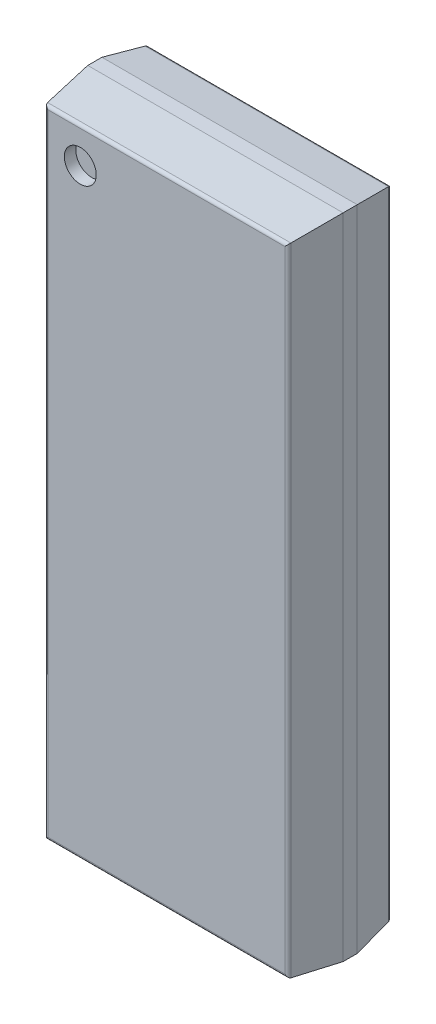
ISO-10303-21;
HEADER;
FILE_DESCRIPTION(('STEP AP214'),'2;1');
FILE_NAME('part.step','',(''),(''),'','','');
FILE_SCHEMA(('AUTOMOTIVE_DESIGN { 1 0 10303 214 1 1 1 1 }'));
ENDSEC;
DATA;
#1=APPLICATION_CONTEXT('core data for automotive mechanical design processes');
#2=APPLICATION_PROTOCOL_DEFINITION('international standard','automotive_design',2000,#1);
#3=PRODUCT_CONTEXT('',#1,'mechanical');
#4=PRODUCT('Part','Part','',(#3));
#5=PRODUCT_RELATED_PRODUCT_CATEGORY('part','',(#4));
#6=PRODUCT_DEFINITION_FORMATION('','',#4);
#7=PRODUCT_DEFINITION_CONTEXT('part definition',#1,'design');
#8=PRODUCT_DEFINITION('design','',#6,#7);
#9=PRODUCT_DEFINITION_SHAPE('','',#8);
#10=(LENGTH_UNIT() NAMED_UNIT(*) SI_UNIT(.MILLI.,.METRE.));
#11=(NAMED_UNIT(*) PLANE_ANGLE_UNIT() SI_UNIT($,.RADIAN.));
#12=(NAMED_UNIT(*) SI_UNIT($,.STERADIAN.) SOLID_ANGLE_UNIT());
#13=UNCERTAINTY_MEASURE_WITH_UNIT(LENGTH_MEASURE(1.E-05),#10,'distance_accuracy_value','');
#14=(GEOMETRIC_REPRESENTATION_CONTEXT(3) GLOBAL_UNCERTAINTY_ASSIGNED_CONTEXT((#13)) GLOBAL_UNIT_ASSIGNED_CONTEXT((#10,
#11,#12)) REPRESENTATION_CONTEXT('',''));
#15=CARTESIAN_POINT('',(0.,0.,0.));
#16=DIRECTION('',(0.,0.,1.));
#17=DIRECTION('',(1.,0.,0.));
#18=AXIS2_PLACEMENT_3D('',#15,#16,#17);
#19=CARTESIAN_POINT('',(-1.31465,4.31615,1.5777));
#20=DIRECTION('',(0.,0.,1.));
#21=DIRECTION('',(1.,0.,0.));
#22=AXIS2_PLACEMENT_3D('',#19,#20,#21);
#23=PLANE('',#22);
#24=CARTESIAN_POINT('',(-1.31465,4.31615,1.5777));
#25=DIRECTION('',(0.,0.,1.));
#26=DIRECTION('',(1.,0.,0.));
#27=AXIS2_PLACEMENT_3D('',#24,#25,#26);
#28=CIRCLE('',#27,0.2436875);
#29=CARTESIAN_POINT('',(-1.0709625,4.31615,1.5777));
#30=VERTEX_POINT('',#29);
#31=EDGE_CURVE('E11',#30,#30,#28,.T.);
#32=ORIENTED_EDGE('',*,*,#31,.T.);
#33=EDGE_LOOP('',(#32));
#34=FACE_BOUND('',#33,.T.);
#35=ADVANCED_FACE('F17',(#34),#23,.T.);
#36=CARTESIAN_POINT('',(-1.31465,4.31615,1.5777));
#37=DIRECTION('',(0.,0.,1.));
#38=DIRECTION('',(1.,0.,0.));
#39=AXIS2_PLACEMENT_3D('',#36,#37,#38);
#40=CYLINDRICAL_SURFACE('',#39,0.2436875);
#41=DIRECTION('',(0.,0.,1.));
#42=VECTOR('',#41,1.);
#43=CARTESIAN_POINT('',(-1.0709625,4.31615,1.5777));
#44=LINE('',#43,#42);
#45=CARTESIAN_POINT('',(-1.0709625,4.31615,1.753));
#46=VERTEX_POINT('',#45);
#47=EDGE_CURVE('E25',#30,#46,#44,.T.);
#48=ORIENTED_EDGE('',*,*,#47,.T.);
#49=CARTESIAN_POINT('',(-1.31465,4.31615,1.753));
#50=DIRECTION('',(0.,0.,1.));
#51=DIRECTION('',(1.,0.,0.));
#52=AXIS2_PLACEMENT_3D('',#49,#50,#51);
#53=CIRCLE('',#52,0.2436875);
#54=EDGE_CURVE('E327',#46,#46,#53,.T.);
#55=ORIENTED_EDGE('',*,*,#54,.T.);
#56=ORIENTED_EDGE('',*,*,#47,.F.);
#57=ORIENTED_EDGE('',*,*,#31,.F.);
#58=EDGE_LOOP('',(#48,#55,#56,#57));
#59=FACE_BOUND('',#58,.T.);
#60=ADVANCED_FACE('F527',(#59),#40,.F.);
#61=CARTESIAN_POINT('',(1.808111155281,-4.853525,1.703));
#62=DIRECTION('',(0.,1.,0.));
#63=DIRECTION('',(0.,0.,1.));
#64=AXIS2_PLACEMENT_3D('',#61,#62,#63);
#65=CYLINDRICAL_SURFACE('',#64,0.05);
#66=CARTESIAN_POINT('',(1.808111155281,-4.809611155281,1.703));
#67=DIRECTION('',(-0.707106781186548,-0.707106781186548,0.));
#68=DIRECTION('',(0.707106781186548,-0.707106781186548,0.));
#69=AXIS2_PLACEMENT_3D('',#66,#67,#68);
#70=ELLIPSE('',#69,0.07071067811865,0.05);
#71=CARTESIAN_POINT('',(1.857692933456,-4.859192933456,1.709453469848));
#72=VERTEX_POINT('',#71);
#73=CARTESIAN_POINT('',(1.808111155281,-4.809611155281,1.753));
#74=VERTEX_POINT('',#73);
#75=EDGE_CURVE('E317',#72,#74,#70,.T.);
#76=ORIENTED_EDGE('',*,*,#75,.F.);
#77=DIRECTION('',(0.,1.,0.));
#78=VECTOR('',#77,1.);
#79=CARTESIAN_POINT('',(1.857692933456,-4.853525,1.709453469848));
#80=LINE('',#79,#78);
#81=CARTESIAN_POINT('',(1.857692933456,4.859192933456,1.709453469848));
#82=VERTEX_POINT('',#81);
#83=EDGE_CURVE('E313',#72,#82,#80,.T.);
#84=ORIENTED_EDGE('',*,*,#83,.T.);
#85=CARTESIAN_POINT('',(1.808111155281,4.809611155281,1.703));
#86=DIRECTION('',(-0.707106781186548,0.707106781186548,0.));
#87=DIRECTION('',(0.707106781186548,0.707106781186548,0.));
#88=AXIS2_PLACEMENT_3D('',#85,#86,#87);
#89=ELLIPSE('',#88,0.07071067811865,0.05);
#90=CARTESIAN_POINT('',(1.808111155281,4.809611155281,1.753));
#91=VERTEX_POINT('',#90);
#92=EDGE_CURVE('E330',#91,#82,#89,.T.);
#93=ORIENTED_EDGE('',*,*,#92,.F.);
#94=DIRECTION('',(0.,1.,0.));
#95=VECTOR('',#94,1.);
#96=CARTESIAN_POINT('',(1.808111155281,-4.853525,1.753));
#97=LINE('',#96,#95);
#98=EDGE_CURVE('E222',#74,#91,#97,.T.);
#99=ORIENTED_EDGE('',*,*,#98,.F.);
#100=EDGE_LOOP('',(#76,#84,#93,#99));
#101=FACE_BOUND('',#100,.T.);
#102=ADVANCED_FACE('F531',(#101),#65,.T.);
#103=CARTESIAN_POINT('',(-1.852025,4.809611155281,1.703));
#104=DIRECTION('',(1.,0.,0.));
#105=DIRECTION('',(0.,0.,1.));
#106=AXIS2_PLACEMENT_3D('',#103,#104,#105);
#107=CYLINDRICAL_SURFACE('',#106,0.05);
#108=DIRECTION('',(1.,0.,0.));
#109=VECTOR('',#108,1.);
#110=CARTESIAN_POINT('',(-1.852025,4.809611155281,1.753));
#111=LINE('',#110,#109);
#112=CARTESIAN_POINT('',(-1.808111155281,4.809611155281,1.753));
#113=VERTEX_POINT('',#112);
#114=EDGE_CURVE('E226',#113,#91,#111,.T.);
#115=ORIENTED_EDGE('',*,*,#114,.T.);
#116=ORIENTED_EDGE('',*,*,#92,.T.);
#117=DIRECTION('',(1.,0.,0.));
#118=VECTOR('',#117,1.);
#119=CARTESIAN_POINT('',(-1.852025,4.859192933456,1.709453469848));
#120=LINE('',#119,#118);
#121=CARTESIAN_POINT('',(-1.857692933456,4.859192933456,1.709453469848));
#122=VERTEX_POINT('',#121);
#123=EDGE_CURVE('E274',#122,#82,#120,.T.);
#124=ORIENTED_EDGE('',*,*,#123,.F.);
#125=CARTESIAN_POINT('',(-1.808111155281,4.809611155281,1.703));
#126=DIRECTION('',(0.707106781186548,0.707106781186548,0.));
#127=DIRECTION('',(-0.707106781186548,0.707106781186548,0.));
#128=AXIS2_PLACEMENT_3D('',#125,#126,#127);
#129=ELLIPSE('',#128,0.07071067811865,0.05);
#130=EDGE_CURVE('E270',#122,#113,#129,.T.);
#131=ORIENTED_EDGE('',*,*,#130,.T.);
#132=EDGE_LOOP('',(#115,#116,#124,#131));
#133=FACE_BOUND('',#132,.T.);
#134=ADVANCED_FACE('F535',(#133),#107,.T.);
#135=CARTESIAN_POINT('',(-1.9495,-4.951,1.753));
#136=DIRECTION('',(0.,0.,1.));
#137=DIRECTION('',(1.,0.,0.));
#138=AXIS2_PLACEMENT_3D('',#135,#136,#137);
#139=PLANE('',#138);
#140=ORIENTED_EDGE('',*,*,#54,.F.);
#141=EDGE_LOOP('',(#140));
#142=FACE_BOUND('',#141,.T.);
#143=DIRECTION('',(0.,1.,0.));
#144=VECTOR('',#143,1.);
#145=CARTESIAN_POINT('',(-1.808111155281,-4.853525,1.753));
#146=LINE('',#145,#144);
#147=CARTESIAN_POINT('',(-1.808111155281,-4.809611155281,1.753));
#148=VERTEX_POINT('',#147);
#149=EDGE_CURVE('E275',#148,#113,#146,.T.);
#150=ORIENTED_EDGE('',*,*,#149,.F.);
#151=DIRECTION('',(1.,0.,0.));
#152=VECTOR('',#151,1.);
#153=CARTESIAN_POINT('',(-1.852025,-4.809611155281,1.753));
#154=LINE('',#153,#152);
#155=EDGE_CURVE('E227',#148,#74,#154,.T.);
#156=ORIENTED_EDGE('',*,*,#155,.T.);
#157=ORIENTED_EDGE('',*,*,#98,.T.);
#158=ORIENTED_EDGE('',*,*,#114,.F.);
#159=EDGE_LOOP('',(#150,#156,#157,#158));
#160=FACE_BOUND('',#159,.T.);
#161=ADVANCED_FACE('F541',(#142,#160),#139,.T.);
#162=CARTESIAN_POINT('',(-1.852025,-4.809611155281,1.703));
#163=DIRECTION('',(1.,0.,0.));
#164=DIRECTION('',(0.,-0.991635563486124,0.129069396952016));
#165=AXIS2_PLACEMENT_3D('',#162,#163,#164);
#166=CYLINDRICAL_SURFACE('',#165,0.05);
#167=DIRECTION('',(1.,0.,0.));
#168=VECTOR('',#167,1.);
#169=CARTESIAN_POINT('',(-1.852025,-4.859192933456,1.709453469848));
#170=LINE('',#169,#168);
#171=CARTESIAN_POINT('',(-1.857692933456,-4.859192933456,1.709453469848));
#172=VERTEX_POINT('',#171);
#173=EDGE_CURVE('E295',#172,#72,#170,.T.);
#174=ORIENTED_EDGE('',*,*,#173,.T.);
#175=ORIENTED_EDGE('',*,*,#75,.T.);
#176=ORIENTED_EDGE('',*,*,#155,.F.);
#177=CARTESIAN_POINT('',(-1.808111155281,-4.809611155281,1.703));
#178=DIRECTION('',(-0.707106781186548,0.707106781186548,0.));
#179=DIRECTION('',(0.707106781186548,0.707106781186548,0.));
#180=AXIS2_PLACEMENT_3D('',#177,#178,#179);
#181=ELLIPSE('',#180,0.07071067811865,0.05);
#182=EDGE_CURVE('E299',#172,#148,#181,.T.);
#183=ORIENTED_EDGE('',*,*,#182,.F.);
#184=EDGE_LOOP('',(#174,#175,#176,#183));
#185=FACE_BOUND('',#184,.T.);
#186=ADVANCED_FACE('F543',(#185),#166,.T.);
#187=CARTESIAN_POINT('',(1.9007625,-4.951,1.378551529514));
#188=DIRECTION('',(0.991635563486124,0.,0.129069396952016));
#189=DIRECTION('',(0.,-1.,0.));
#190=AXIS2_PLACEMENT_3D('',#187,#188,#189);
#191=PLANE('',#190);
#192=DIRECTION('',(-0.128007567691047,0.128007567691047,0.98347756722136));
#193=VECTOR('',#192,1.);
#194=CARTESIAN_POINT('',(1.869616724689,-4.871116724689,1.61784340799));
#195=LINE('',#194,#193);
#196=CARTESIAN_POINT('',(1.9495,-4.951,1.004103059027));
#197=VERTEX_POINT('',#196);
#198=EDGE_CURVE('E291',#197,#72,#195,.T.);
#199=ORIENTED_EDGE('',*,*,#198,.F.);
#200=DIRECTION('',(0.,1.,0.));
#201=VECTOR('',#200,1.);
#202=CARTESIAN_POINT('',(1.9495,-4.951,1.004103059027));
#203=LINE('',#202,#201);
#204=CARTESIAN_POINT('',(1.9495,4.951,1.004103059027));
#205=VERTEX_POINT('',#204);
#206=EDGE_CURVE('E287',#197,#205,#203,.T.);
#207=ORIENTED_EDGE('',*,*,#206,.T.);
#208=DIRECTION('',(-0.128007567691047,-0.128007567691047,0.98347756722136));
#209=VECTOR('',#208,1.);
#210=CARTESIAN_POINT('',(1.788489948691,4.789989948691,2.241137528291));
#211=LINE('',#210,#209);
#212=EDGE_CURVE('E309',#205,#82,#211,.T.);
#213=ORIENTED_EDGE('',*,*,#212,.T.);
#214=ORIENTED_EDGE('',*,*,#83,.F.);
#215=EDGE_LOOP('',(#199,#207,#213,#214));
#216=FACE_BOUND('',#215,.T.);
#217=ADVANCED_FACE('F548',(#216),#191,.T.);
#218=CARTESIAN_POINT('',(-1.9495,4.9022625,1.378551529514));
#219=DIRECTION('',(0.,0.991635563486124,0.129069396952016));
#220=DIRECTION('',(1.,0.,0.));
#221=AXIS2_PLACEMENT_3D('',#218,#219,#220);
#222=PLANE('',#221);
#223=ORIENTED_EDGE('',*,*,#123,.T.);
#224=ORIENTED_EDGE('',*,*,#212,.F.);
#225=DIRECTION('',(1.,0.,0.));
#226=VECTOR('',#225,1.);
#227=CARTESIAN_POINT('',(-1.9495,4.951,1.004103059027));
#228=LINE('',#227,#226);
#229=CARTESIAN_POINT('',(-1.9495,4.951,1.004103059027));
#230=VERTEX_POINT('',#229);
#231=EDGE_CURVE('E283',#230,#205,#228,.T.);
#232=ORIENTED_EDGE('',*,*,#231,.F.);
#233=DIRECTION('',(0.128007567691047,-0.128007567691047,0.98347756722136));
#234=VECTOR('',#233,1.);
#235=CARTESIAN_POINT('',(-1.820434333625,4.821934333625,1.995709960622));
#236=LINE('',#235,#234);
#237=EDGE_CURVE('E219',#230,#122,#236,.T.);
#238=ORIENTED_EDGE('',*,*,#237,.T.);
#239=EDGE_LOOP('',(#223,#224,#232,#238));
#240=FACE_BOUND('',#239,.T.);
#241=ADVANCED_FACE('F509',(#240),#222,.T.);
#242=CARTESIAN_POINT('',(-1.808111155281,-4.853525,1.703));
#243=DIRECTION('',(0.,1.,0.));
#244=DIRECTION('',(-0.991635563486124,0.,0.129069396952016));
#245=AXIS2_PLACEMENT_3D('',#242,#243,#244);
#246=CYLINDRICAL_SURFACE('',#245,0.05);
#247=ORIENTED_EDGE('',*,*,#182,.T.);
#248=ORIENTED_EDGE('',*,*,#149,.T.);
#249=ORIENTED_EDGE('',*,*,#130,.F.);
#250=DIRECTION('',(0.,1.,0.));
#251=VECTOR('',#250,1.);
#252=CARTESIAN_POINT('',(-1.857692933456,-4.853525,1.709453469848));
#253=LINE('',#252,#251);
#254=EDGE_CURVE('E216',#172,#122,#253,.T.);
#255=ORIENTED_EDGE('',*,*,#254,.F.);
#256=EDGE_LOOP('',(#247,#248,#249,#255));
#257=FACE_BOUND('',#256,.T.);
#258=ADVANCED_FACE('F505',(#257),#246,.T.);
#259=CARTESIAN_POINT('',(-1.9495,-4.9022625,1.378551529514));
#260=DIRECTION('',(0.,0.991635563486124,-0.129069396952016));
#261=DIRECTION('',(-1.,0.,0.));
#262=AXIS2_PLACEMENT_3D('',#259,#260,#261);
#263=PLANE('',#262);
#264=DIRECTION('',(0.128007567691047,0.128007567691047,0.98347756722136));
#265=VECTOR('',#264,1.);
#266=CARTESIAN_POINT('',(-1.901561109623,-4.903061109623,1.372415840322));
#267=LINE('',#266,#265);
#268=CARTESIAN_POINT('',(-1.9495,-4.951,1.004103059027));
#269=VERTEX_POINT('',#268);
#270=EDGE_CURVE('E241',#269,#172,#267,.T.);
#271=ORIENTED_EDGE('',*,*,#270,.F.);
#272=DIRECTION('',(1.,0.,0.));
#273=VECTOR('',#272,1.);
#274=CARTESIAN_POINT('',(-1.9495,-4.951,1.004103059027));
#275=LINE('',#274,#273);
#276=EDGE_CURVE('E148',#269,#197,#275,.T.);
#277=ORIENTED_EDGE('',*,*,#276,.T.);
#278=ORIENTED_EDGE('',*,*,#198,.T.);
#279=ORIENTED_EDGE('',*,*,#173,.F.);
#280=EDGE_LOOP('',(#271,#277,#278,#279));
#281=FACE_BOUND('',#280,.T.);
#282=ADVANCED_FACE('F497',(#281),#263,.F.);
#283=CARTESIAN_POINT('',(1.9495,-4.951,0.178));
#284=DIRECTION('',(1.,0.,0.));
#285=DIRECTION('',(0.,1.,0.));
#286=AXIS2_PLACEMENT_3D('',#283,#284,#285);
#287=PLANE('',#286);
#288=DIRECTION('',(0.,0.,1.));
#289=VECTOR('',#288,1.);
#290=CARTESIAN_POINT('',(1.9495,-4.951,0.178));
#291=LINE('',#290,#289);
#292=CARTESIAN_POINT('',(1.9495,-4.951,0.788103059027));
#293=VERTEX_POINT('',#292);
#294=EDGE_CURVE('E259',#293,#197,#291,.T.);
#295=ORIENTED_EDGE('',*,*,#294,.F.);
#296=DIRECTION('',(0.,1.,0.));
#297=VECTOR('',#296,1.);
#298=CARTESIAN_POINT('',(1.9495,-4.951,0.788103059027));
#299=LINE('',#298,#297);
#300=CARTESIAN_POINT('',(1.9495,4.951,0.788103059027));
#301=VERTEX_POINT('',#300);
#302=EDGE_CURVE('E247',#293,#301,#299,.T.);
#303=ORIENTED_EDGE('',*,*,#302,.T.);
#304=DIRECTION('',(0.,0.,1.));
#305=VECTOR('',#304,1.);
#306=CARTESIAN_POINT('',(1.9495,4.951,0.178));
#307=LINE('',#306,#305);
#308=EDGE_CURVE('E279',#301,#205,#307,.T.);
#309=ORIENTED_EDGE('',*,*,#308,.T.);
#310=ORIENTED_EDGE('',*,*,#206,.F.);
#311=EDGE_LOOP('',(#295,#303,#309,#310));
#312=FACE_BOUND('',#311,.T.);
#313=ADVANCED_FACE('F495',(#312),#287,.T.);
#314=CARTESIAN_POINT('',(1.809379279549,-4.853525,0.228));
#315=DIRECTION('',(0.,1.,0.));
#316=DIRECTION('',(0.,0.,-1.));
#317=AXIS2_PLACEMENT_3D('',#314,#315,#316);
#318=CYLINDRICAL_SURFACE('',#317,0.05);
#319=DIRECTION('',(0.,1.,0.));
#320=VECTOR('',#319,1.);
#321=CARTESIAN_POINT('',(1.809379279549,-4.853525,0.178));
#322=LINE('',#321,#320);
#323=CARTESIAN_POINT('',(1.809379279549,-4.810879279549,0.178));
#324=VERTEX_POINT('',#323);
#325=CARTESIAN_POINT('',(1.809379279549,4.810879279549,0.178));
#326=VERTEX_POINT('',#325);
#327=EDGE_CURVE('E246',#324,#326,#322,.T.);
#328=ORIENTED_EDGE('',*,*,#327,.T.);
#329=CARTESIAN_POINT('',(1.809379279549,4.810879279549,0.228));
#330=DIRECTION('',(0.707106781186548,-0.707106781186548,0.));
#331=DIRECTION('',(0.707106781186548,0.707106781186548,0.));
#332=AXIS2_PLACEMENT_3D('',#329,#330,#331);
#333=ELLIPSE('',#332,0.07071067811865,0.05);
#334=CARTESIAN_POINT('',(1.858753096203,4.860253096203,0.220111639653));
#335=VERTEX_POINT('',#334);
#336=EDGE_CURVE('E220',#326,#335,#333,.T.);
#337=ORIENTED_EDGE('',*,*,#336,.T.);
#338=DIRECTION('',(0.,1.,0.));
#339=VECTOR('',#338,1.);
#340=CARTESIAN_POINT('',(1.858753096203,-4.853525,0.220111639653));
#341=LINE('',#340,#339);
#342=CARTESIAN_POINT('',(1.858753096203,-4.860253096203,0.220111639653));
#343=VERTEX_POINT('',#342);
#344=EDGE_CURVE('E253',#343,#335,#341,.T.);
#345=ORIENTED_EDGE('',*,*,#344,.F.);
#346=CARTESIAN_POINT('',(1.809379279549,-4.810879279549,0.228));
#347=DIRECTION('',(0.707106781186548,0.707106781186548,0.));
#348=DIRECTION('',(0.707106781186548,-0.707106781186548,0.));
#349=AXIS2_PLACEMENT_3D('',#346,#347,#348);
#350=ELLIPSE('',#349,0.07071067811865,0.05);
#351=EDGE_CURVE('E207',#343,#324,#350,.T.);
#352=ORIENTED_EDGE('',*,*,#351,.T.);
#353=EDGE_LOOP('',(#328,#337,#345,#352));
#354=FACE_BOUND('',#353,.T.);
#355=ADVANCED_FACE('F488',(#354),#318,.T.);
#356=CARTESIAN_POINT('',(-1.9495,4.951,0.178));
#357=DIRECTION('',(0.,1.,0.));
#358=DIRECTION('',(1.,0.,0.));
#359=AXIS2_PLACEMENT_3D('',#356,#357,#358);
#360=PLANE('',#359);
#361=ORIENTED_EDGE('',*,*,#308,.F.);
#362=DIRECTION('',(1.,0.,0.));
#363=VECTOR('',#362,1.);
#364=CARTESIAN_POINT('',(-1.9495,4.951,0.788103059027));
#365=LINE('',#364,#363);
#366=CARTESIAN_POINT('',(-1.9495,4.951,0.788103059027));
#367=VERTEX_POINT('',#366);
#368=EDGE_CURVE('E154',#367,#301,#365,.T.);
#369=ORIENTED_EDGE('',*,*,#368,.F.);
#370=DIRECTION('',(0.,0.,1.));
#371=VECTOR('',#370,1.);
#372=CARTESIAN_POINT('',(-1.9495,4.951,0.178));
#373=LINE('',#372,#371);
#374=EDGE_CURVE('E155',#367,#230,#373,.T.);
#375=ORIENTED_EDGE('',*,*,#374,.T.);
#376=ORIENTED_EDGE('',*,*,#231,.T.);
#377=EDGE_LOOP('',(#361,#369,#375,#376));
#378=FACE_BOUND('',#377,.T.);
#379=ADVANCED_FACE('F511',(#378),#360,.T.);
#380=CARTESIAN_POINT('',(-1.9007625,-4.951,1.378551529514));
#381=DIRECTION('',(0.991635563486124,0.,-0.129069396952016));
#382=DIRECTION('',(0.,-1.,0.));
#383=AXIS2_PLACEMENT_3D('',#380,#381,#382);
#384=PLANE('',#383);
#385=ORIENTED_EDGE('',*,*,#254,.T.);
#386=ORIENTED_EDGE('',*,*,#237,.F.);
#387=DIRECTION('',(0.,1.,0.));
#388=VECTOR('',#387,1.);
#389=CARTESIAN_POINT('',(-1.9495,-4.951,1.004103059027));
#390=LINE('',#389,#388);
#391=EDGE_CURVE('E196',#269,#230,#390,.T.);
#392=ORIENTED_EDGE('',*,*,#391,.F.);
#393=ORIENTED_EDGE('',*,*,#270,.T.);
#394=EDGE_LOOP('',(#385,#386,#392,#393));
#395=FACE_BOUND('',#394,.T.);
#396=ADVANCED_FACE('F501',(#395),#384,.F.);
#397=CARTESIAN_POINT('',(-1.852025,4.810879279549,0.228));
#398=DIRECTION('',(1.,0.,0.));
#399=DIRECTION('',(0.,0.,-1.));
#400=AXIS2_PLACEMENT_3D('',#397,#398,#399);
#401=CYLINDRICAL_SURFACE('',#400,0.05);
#402=CARTESIAN_POINT('',(-1.809379279549,4.810879279549,0.228));
#403=DIRECTION('',(-0.707106781186548,-0.707106781186548,0.));
#404=DIRECTION('',(-0.707106781186548,0.707106781186548,0.));
#405=AXIS2_PLACEMENT_3D('',#402,#403,#404);
#406=ELLIPSE('',#405,0.07071067811865,0.05);
#407=CARTESIAN_POINT('',(-1.858753096203,4.860253096203,0.220111639653));
#408=VERTEX_POINT('',#407);
#409=CARTESIAN_POINT('',(-1.809379279549,4.810879279549,0.178));
#410=VERTEX_POINT('',#409);
#411=EDGE_CURVE('E166',#408,#410,#406,.T.);
#412=ORIENTED_EDGE('',*,*,#411,.F.);
#413=DIRECTION('',(1.,0.,0.));
#414=VECTOR('',#413,1.);
#415=CARTESIAN_POINT('',(-1.852025,4.860253096203,0.220111639653));
#416=LINE('',#415,#414);
#417=EDGE_CURVE('E231',#408,#335,#416,.T.);
#418=ORIENTED_EDGE('',*,*,#417,.T.);
#419=ORIENTED_EDGE('',*,*,#336,.F.);
#420=DIRECTION('',(1.,0.,0.));
#421=VECTOR('',#420,1.);
#422=CARTESIAN_POINT('',(-1.852025,4.810879279549,0.178));
#423=LINE('',#422,#421);
#424=EDGE_CURVE('E242',#410,#326,#423,.T.);
#425=ORIENTED_EDGE('',*,*,#424,.F.);
#426=EDGE_LOOP('',(#412,#418,#419,#425));
#427=FACE_BOUND('',#426,.T.);
#428=ADVANCED_FACE('F515',(#427),#401,.T.);
#429=CARTESIAN_POINT('',(-1.9495,-4.951,0.178));
#430=DIRECTION('',(0.,0.,1.));
#431=DIRECTION('',(1.,0.,0.));
#432=AXIS2_PLACEMENT_3D('',#429,#430,#431);
#433=PLANE('',#432);
#434=ORIENTED_EDGE('',*,*,#424,.T.);
#435=ORIENTED_EDGE('',*,*,#327,.F.);
#436=DIRECTION('',(1.,0.,0.));
#437=VECTOR('',#436,1.);
#438=CARTESIAN_POINT('',(-1.852025,-4.810879279549,0.178));
#439=LINE('',#438,#437);
#440=CARTESIAN_POINT('',(-1.809379279549,-4.810879279549,0.178));
#441=VERTEX_POINT('',#440);
#442=EDGE_CURVE('E211',#441,#324,#439,.T.);
#443=ORIENTED_EDGE('',*,*,#442,.F.);
#444=DIRECTION('',(0.,1.,0.));
#445=VECTOR('',#444,1.);
#446=CARTESIAN_POINT('',(-1.809379279549,-4.853525,0.178));
#447=LINE('',#446,#445);
#448=EDGE_CURVE('E200',#441,#410,#447,.T.);
#449=ORIENTED_EDGE('',*,*,#448,.T.);
#450=EDGE_LOOP('',(#434,#435,#443,#449));
#451=FACE_BOUND('',#450,.T.);
#452=ADVANCED_FACE('F486',(#451),#433,.F.);
#453=CARTESIAN_POINT('',(1.9007625,-4.951,0.483051529514));
#454=DIRECTION('',(-0.987476333090755,0.,0.157767206939961));
#455=DIRECTION('',(0.,1.,0.));
#456=AXIS2_PLACEMENT_3D('',#453,#454,#455);
#457=PLANE('',#456);
#458=ORIENTED_EDGE('',*,*,#344,.T.);
#459=DIRECTION('',(-0.155839664655945,-0.155839664655945,-0.975411706839653));
#460=VECTOR('',#459,1.);
#461=CARTESIAN_POINT('',(1.734360588525,4.735860588525,-0.558470042364));
#462=LINE('',#461,#460);
#463=EDGE_CURVE('E194',#301,#335,#462,.T.);
#464=ORIENTED_EDGE('',*,*,#463,.F.);
#465=ORIENTED_EDGE('',*,*,#302,.F.);
#466=DIRECTION('',(-0.155839664655945,0.155839664655945,-0.975411706839653));
#467=VECTOR('',#466,1.);
#468=CARTESIAN_POINT('',(1.854600579872,-4.856100579872,0.19412074028));
#469=LINE('',#468,#467);
#470=EDGE_CURVE('E164',#293,#343,#469,.T.);
#471=ORIENTED_EDGE('',*,*,#470,.T.);
#472=EDGE_LOOP('',(#458,#464,#465,#471));
#473=FACE_BOUND('',#472,.T.);
#474=ADVANCED_FACE('F490',(#473),#457,.F.);
#475=CARTESIAN_POINT('',(-1.9495,-4.951,0.178));
#476=DIRECTION('',(0.,1.,0.));
#477=DIRECTION('',(1.,0.,0.));
#478=AXIS2_PLACEMENT_3D('',#475,#476,#477);
#479=PLANE('',#478);
#480=ORIENTED_EDGE('',*,*,#276,.F.);
#481=DIRECTION('',(0.,0.,1.));
#482=VECTOR('',#481,1.);
#483=CARTESIAN_POINT('',(-1.9495,-4.951,0.178));
#484=LINE('',#483,#482);
#485=CARTESIAN_POINT('',(-1.9495,-4.951,0.788103059027));
#486=VERTEX_POINT('',#485);
#487=EDGE_CURVE('E141',#486,#269,#484,.T.);
#488=ORIENTED_EDGE('',*,*,#487,.F.);
#489=DIRECTION('',(1.,0.,0.));
#490=VECTOR('',#489,1.);
#491=CARTESIAN_POINT('',(-1.9495,-4.951,0.788103059027));
#492=LINE('',#491,#490);
#493=EDGE_CURVE('E145',#486,#293,#492,.T.);
#494=ORIENTED_EDGE('',*,*,#493,.T.);
#495=ORIENTED_EDGE('',*,*,#294,.T.);
#496=EDGE_LOOP('',(#480,#488,#494,#495));
#497=FACE_BOUND('',#496,.T.);
#498=ADVANCED_FACE('F143',(#497),#479,.F.);
#499=CARTESIAN_POINT('',(-1.852025,-4.810879279549,0.228));
#500=DIRECTION('',(1.,0.,0.));
#501=DIRECTION('',(0.,-0.987476333090755,-0.157767206939961));
#502=AXIS2_PLACEMENT_3D('',#499,#500,#501);
#503=CYLINDRICAL_SURFACE('',#502,0.05);
#504=CARTESIAN_POINT('',(-1.809379279549,-4.810879279549,0.228));
#505=DIRECTION('',(0.707106781186548,-0.707106781186548,0.));
#506=DIRECTION('',(0.707106781186548,0.707106781186548,0.));
#507=AXIS2_PLACEMENT_3D('',#504,#505,#506);
#508=ELLIPSE('',#507,0.07071067811865,0.05);
#509=CARTESIAN_POINT('',(-1.858753096203,-4.860253096203,0.220111639653));
#510=VERTEX_POINT('',#509);
#511=EDGE_CURVE('E190',#510,#441,#508,.T.);
#512=ORIENTED_EDGE('',*,*,#511,.T.);
#513=ORIENTED_EDGE('',*,*,#442,.T.);
#514=ORIENTED_EDGE('',*,*,#351,.F.);
#515=DIRECTION('',(1.,0.,0.));
#516=VECTOR('',#515,1.);
#517=CARTESIAN_POINT('',(-1.852025,-4.860253096203,0.220111639653));
#518=LINE('',#517,#516);
#519=EDGE_CURVE('E206',#510,#343,#518,.T.);
#520=ORIENTED_EDGE('',*,*,#519,.F.);
#521=EDGE_LOOP('',(#512,#513,#514,#520));
#522=FACE_BOUND('',#521,.T.);
#523=ADVANCED_FACE('F480',(#522),#503,.T.);
#524=CARTESIAN_POINT('',(-1.9495,4.9022625,0.483051529514));
#525=DIRECTION('',(0.,-0.987476333090755,0.157767206939961));
#526=DIRECTION('',(-1.,0.,0.));
#527=AXIS2_PLACEMENT_3D('',#524,#525,#526);
#528=PLANE('',#527);
#529=DIRECTION('',(0.155839664655945,-0.155839664655945,-0.975411706839653));
#530=VECTOR('',#529,1.);
#531=CARTESIAN_POINT('',(-1.781706147631,4.783206147631,-0.262130771355));
#532=LINE('',#531,#530);
#533=EDGE_CURVE('E177',#367,#408,#532,.T.);
#534=ORIENTED_EDGE('',*,*,#533,.F.);
#535=ORIENTED_EDGE('',*,*,#368,.T.);
#536=ORIENTED_EDGE('',*,*,#463,.T.);
#537=ORIENTED_EDGE('',*,*,#417,.F.);
#538=EDGE_LOOP('',(#534,#535,#536,#537));
#539=FACE_BOUND('',#538,.T.);
#540=ADVANCED_FACE('F513',(#539),#528,.F.);
#541=CARTESIAN_POINT('',(-1.9495,-4.951,0.178));
#542=DIRECTION('',(1.,0.,0.));
#543=DIRECTION('',(0.,1.,0.));
#544=AXIS2_PLACEMENT_3D('',#541,#542,#543);
#545=PLANE('',#544);
#546=ORIENTED_EDGE('',*,*,#391,.T.);
#547=ORIENTED_EDGE('',*,*,#374,.F.);
#548=DIRECTION('',(0.,1.,0.));
#549=VECTOR('',#548,1.);
#550=CARTESIAN_POINT('',(-1.9495,-4.951,0.788103059027));
#551=LINE('',#550,#549);
#552=EDGE_CURVE('E170',#486,#367,#551,.T.);
#553=ORIENTED_EDGE('',*,*,#552,.F.);
#554=ORIENTED_EDGE('',*,*,#487,.T.);
#555=EDGE_LOOP('',(#546,#547,#553,#554));
#556=FACE_BOUND('',#555,.T.);
#557=ADVANCED_FACE('F171',(#556),#545,.F.);
#558=CARTESIAN_POINT('',(-1.809379279549,-4.853525,0.228));
#559=DIRECTION('',(0.,1.,0.));
#560=DIRECTION('',(-0.987476333090755,0.,-0.157767206939961));
#561=AXIS2_PLACEMENT_3D('',#558,#559,#560);
#562=CYLINDRICAL_SURFACE('',#561,0.05);
#563=DIRECTION('',(0.,1.,0.));
#564=VECTOR('',#563,1.);
#565=CARTESIAN_POINT('',(-1.858753096203,-4.853525,0.220111639653));
#566=LINE('',#565,#564);
#567=EDGE_CURVE('E182',#510,#408,#566,.T.);
#568=ORIENTED_EDGE('',*,*,#567,.T.);
#569=ORIENTED_EDGE('',*,*,#411,.T.);
#570=ORIENTED_EDGE('',*,*,#448,.F.);
#571=ORIENTED_EDGE('',*,*,#511,.F.);
#572=EDGE_LOOP('',(#568,#569,#570,#571));
#573=FACE_BOUND('',#572,.T.);
#574=ADVANCED_FACE('F483',(#573),#562,.T.);
#575=CARTESIAN_POINT('',(-1.9495,-4.9022625,0.483051529514));
#576=DIRECTION('',(0.,-0.987476333090755,-0.157767206939961));
#577=DIRECTION('',(0.,0.157767206939961,-0.987476333090755));
#578=AXIS2_PLACEMENT_3D('',#575,#576,#577);
#579=PLANE('',#578);
#580=ORIENTED_EDGE('',*,*,#519,.T.);
#581=ORIENTED_EDGE('',*,*,#470,.F.);
#582=ORIENTED_EDGE('',*,*,#493,.F.);
#583=DIRECTION('',(0.155839664655945,0.155839664655945,-0.975411706839653));
#584=VECTOR('',#583,1.);
#585=CARTESIAN_POINT('',(-1.901946138978,-4.903446138978,0.490460011289));
#586=LINE('',#585,#584);
#587=EDGE_CURVE('E162',#486,#510,#586,.T.);
#588=ORIENTED_EDGE('',*,*,#587,.T.);
#589=EDGE_LOOP('',(#580,#581,#582,#588));
#590=FACE_BOUND('',#589,.T.);
#591=ADVANCED_FACE('F160',(#590),#579,.T.);
#592=CARTESIAN_POINT('',(-1.9007625,-4.951,0.483051529514));
#593=DIRECTION('',(-0.987476333090755,0.,-0.157767206939961));
#594=DIRECTION('',(-0.157767206939961,0.,0.987476333090755));
#595=AXIS2_PLACEMENT_3D('',#592,#593,#594);
#596=PLANE('',#595);
#597=ORIENTED_EDGE('',*,*,#587,.F.);
#598=ORIENTED_EDGE('',*,*,#552,.T.);
#599=ORIENTED_EDGE('',*,*,#533,.T.);
#600=ORIENTED_EDGE('',*,*,#567,.F.);
#601=EDGE_LOOP('',(#597,#598,#599,#600));
#602=FACE_BOUND('',#601,.T.);
#603=ADVANCED_FACE('F180',(#602),#596,.T.);
#604=CLOSED_SHELL('',(#35,#60,#102,#134,#161,#186,#217,#241,#258,#282,#313,#355,#379,#396,#428,
#452,#474,#498,#523,#540,#557,#574,#591,#603));
#605=MANIFOLD_SOLID_BREP('B1',#604);
#606=ADVANCED_BREP_SHAPE_REPRESENTATION('',(#18,#605),#14);
#607=SHAPE_DEFINITION_REPRESENTATION(#9,#606);
ENDSEC;
END-ISO-10303-21;
